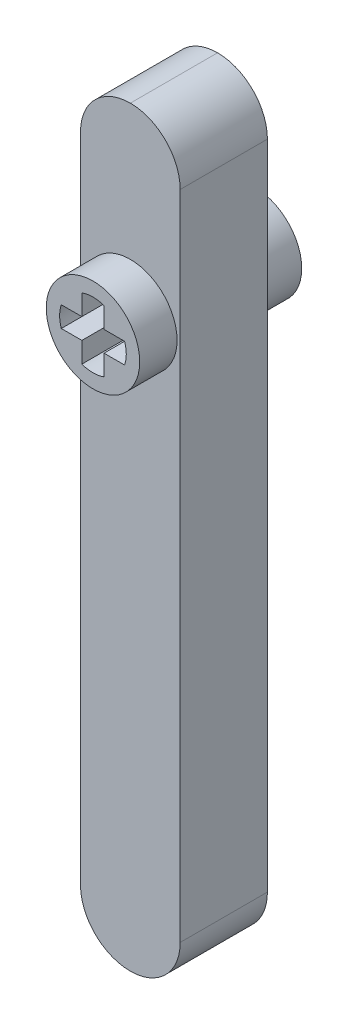
ISO-10303-21;
HEADER;
FILE_DESCRIPTION(('STEP AP214'),'2;1');
FILE_NAME('part.step','',(''),(''),'','','');
FILE_SCHEMA(('AUTOMOTIVE_DESIGN { 1 0 10303 214 1 1 1 1 }'));
ENDSEC;
DATA;
#1=APPLICATION_CONTEXT('core data for automotive mechanical design processes');
#2=APPLICATION_PROTOCOL_DEFINITION('international standard','automotive_design',2000,#1);
#3=PRODUCT_CONTEXT('',#1,'mechanical');
#4=PRODUCT('Part','Part','',(#3));
#5=PRODUCT_RELATED_PRODUCT_CATEGORY('part','',(#4));
#6=PRODUCT_DEFINITION_FORMATION('','',#4);
#7=PRODUCT_DEFINITION_CONTEXT('part definition',#1,'design');
#8=PRODUCT_DEFINITION('design','',#6,#7);
#9=PRODUCT_DEFINITION_SHAPE('','',#8);
#10=(LENGTH_UNIT() NAMED_UNIT(*) SI_UNIT(.MILLI.,.METRE.));
#11=(NAMED_UNIT(*) PLANE_ANGLE_UNIT() SI_UNIT($,.RADIAN.));
#12=(NAMED_UNIT(*) SI_UNIT($,.STERADIAN.) SOLID_ANGLE_UNIT());
#13=UNCERTAINTY_MEASURE_WITH_UNIT(LENGTH_MEASURE(1.E-05),#10,'distance_accuracy_value','');
#14=(GEOMETRIC_REPRESENTATION_CONTEXT(3) GLOBAL_UNCERTAINTY_ASSIGNED_CONTEXT((#13)) GLOBAL_UNIT_ASSIGNED_CONTEXT((#10,
#11,#12)) REPRESENTATION_CONTEXT('',''));
#15=CARTESIAN_POINT('',(0.,0.,0.));
#16=DIRECTION('',(0.,0.,1.));
#17=DIRECTION('',(1.,0.,0.));
#18=AXIS2_PLACEMENT_3D('',#15,#16,#17);
#19=CARTESIAN_POINT('',(0.,20.32,-2.99999997));
#20=DIRECTION('',(0.,0.,1.));
#21=DIRECTION('',(1.,0.,0.));
#22=AXIS2_PLACEMENT_3D('',#19,#20,#21);
#23=PLANE('',#22);
#24=CARTESIAN_POINT('',(0.,20.32,-2.99999997));
#25=DIRECTION('',(0.,0.,1.));
#26=DIRECTION('',(1.,0.,0.));
#27=AXIS2_PLACEMENT_3D('',#24,#25,#26);
#28=CIRCLE('',#27,3.75);
#29=CARTESIAN_POINT('',(3.75,20.32,-2.99999997));
#30=VERTEX_POINT('',#29);
#31=EDGE_CURVE('E263',#30,#30,#28,.T.);
#32=ORIENTED_EDGE('',*,*,#31,.F.);
#33=EDGE_LOOP('',(#32));
#34=FACE_BOUND('',#33,.T.);
#35=CARTESIAN_POINT('',(-0.0745284933708927,20.32,-2.99999997));
#36=DIRECTION('',(0.,0.,-1.));
#37=DIRECTION('',(-1.,0.,0.));
#38=AXIS2_PLACEMENT_3D('',#35,#36,#37);
#39=CIRCLE('',#38,2.6);
#40=CARTESIAN_POINT('',(-2.54,21.1455,-2.99999997));
#41=VERTEX_POINT('',#40);
#42=CARTESIAN_POINT('',(-2.54,19.4945,-2.99999997));
#43=VERTEX_POINT('',#42);
#44=EDGE_CURVE('E54',#41,#43,#39,.F.);
#45=ORIENTED_EDGE('',*,*,#44,.T.);
#46=DIRECTION('',(-1.,0.,0.));
#47=VECTOR('',#46,1.);
#48=CARTESIAN_POINT('',(0.,19.4945,-2.99999997));
#49=LINE('',#48,#47);
#50=CARTESIAN_POINT('',(-0.889,19.4945,-2.99999997));
#51=VERTEX_POINT('',#50);
#52=EDGE_CURVE('E181',#51,#43,#49,.T.);
#53=ORIENTED_EDGE('',*,*,#52,.F.);
#54=DIRECTION('',(0.,1.,0.));
#55=VECTOR('',#54,1.);
#56=CARTESIAN_POINT('',(-0.889000000000005,0.,-2.99999997));
#57=LINE('',#56,#55);
#58=CARTESIAN_POINT('',(-0.889000000000001,17.8435,-2.99999997));
#59=VERTEX_POINT('',#58);
#60=EDGE_CURVE('E184',#59,#51,#57,.T.);
#61=ORIENTED_EDGE('',*,*,#60,.F.);
#62=CARTESIAN_POINT('',(0.,20.286792655414,-2.99999997));
#63=DIRECTION('',(0.,0.,-1.));
#64=DIRECTION('',(-1.,0.,0.));
#65=AXIS2_PLACEMENT_3D('',#62,#63,#64);
#66=CIRCLE('',#65,2.6);
#67=CARTESIAN_POINT('',(0.889000000000001,17.8435,-2.99999997));
#68=VERTEX_POINT('',#67);
#69=EDGE_CURVE('E234',#68,#59,#66,.T.);
#70=ORIENTED_EDGE('',*,*,#69,.F.);
#71=DIRECTION('',(0.,-1.,0.));
#72=VECTOR('',#71,1.);
#73=CARTESIAN_POINT('',(0.889000000000003,0.,-2.99999997));
#74=LINE('',#73,#72);
#75=CARTESIAN_POINT('',(0.889,19.4945,-2.99999997));
#76=VERTEX_POINT('',#75);
#77=EDGE_CURVE('E231',#76,#68,#74,.T.);
#78=ORIENTED_EDGE('',*,*,#77,.F.);
#79=DIRECTION('',(-1.,0.,0.));
#80=VECTOR('',#79,1.);
#81=CARTESIAN_POINT('',(0.,19.4945,-2.99999997));
#82=LINE('',#81,#80);
#83=CARTESIAN_POINT('',(2.54,19.4945,-2.99999997));
#84=VERTEX_POINT('',#83);
#85=EDGE_CURVE('E228',#84,#76,#82,.T.);
#86=ORIENTED_EDGE('',*,*,#85,.F.);
#87=CARTESIAN_POINT('',(0.0745284933708927,20.32,-2.99999997));
#88=DIRECTION('',(0.,0.,-1.));
#89=DIRECTION('',(-1.,0.,0.));
#90=AXIS2_PLACEMENT_3D('',#87,#88,#89);
#91=CIRCLE('',#90,2.6);
#92=CARTESIAN_POINT('',(2.54,21.1455,-2.99999997));
#93=VERTEX_POINT('',#92);
#94=EDGE_CURVE('E225',#93,#84,#91,.T.);
#95=ORIENTED_EDGE('',*,*,#94,.F.);
#96=DIRECTION('',(1.,0.,0.));
#97=VECTOR('',#96,1.);
#98=CARTESIAN_POINT('',(0.,21.1455,-2.99999997));
#99=LINE('',#98,#97);
#100=CARTESIAN_POINT('',(0.889,21.1455,-2.99999997));
#101=VERTEX_POINT('',#100);
#102=EDGE_CURVE('E222',#101,#93,#99,.T.);
#103=ORIENTED_EDGE('',*,*,#102,.F.);
#104=DIRECTION('',(0.,1.,0.));
#105=VECTOR('',#104,1.);
#106=CARTESIAN_POINT('',(0.888999999999995,0.,-2.99999997));
#107=LINE('',#106,#105);
#108=CARTESIAN_POINT('',(0.889000000000001,22.7965,-2.99999997));
#109=VERTEX_POINT('',#108);
#110=EDGE_CURVE('E219',#101,#109,#107,.T.);
#111=ORIENTED_EDGE('',*,*,#110,.T.);
#112=CARTESIAN_POINT('',(0.,20.353207344586,-2.99999997));
#113=DIRECTION('',(0.,0.,-1.));
#114=DIRECTION('',(-1.,0.,0.));
#115=AXIS2_PLACEMENT_3D('',#112,#113,#114);
#116=CIRCLE('',#115,2.6);
#117=CARTESIAN_POINT('',(-0.889000000000001,22.7965,-2.99999997));
#118=VERTEX_POINT('',#117);
#119=EDGE_CURVE('E216',#109,#118,#116,.F.);
#120=ORIENTED_EDGE('',*,*,#119,.T.);
#121=DIRECTION('',(0.,-1.,0.));
#122=VECTOR('',#121,1.);
#123=CARTESIAN_POINT('',(-0.888999999999995,0.,-2.99999997));
#124=LINE('',#123,#122);
#125=CARTESIAN_POINT('',(-0.889,21.1455,-2.99999997));
#126=VERTEX_POINT('',#125);
#127=EDGE_CURVE('E213',#118,#126,#124,.T.);
#128=ORIENTED_EDGE('',*,*,#127,.T.);
#129=DIRECTION('',(-1.,0.,0.));
#130=VECTOR('',#129,1.);
#131=CARTESIAN_POINT('',(0.,21.1455,-2.99999997));
#132=LINE('',#131,#130);
#133=EDGE_CURVE('E211',#126,#41,#132,.T.);
#134=ORIENTED_EDGE('',*,*,#133,.T.);
#135=EDGE_LOOP('',(#45,#53,#61,#70,#78,#86,#95,#103,#111,#120,#128,#134));
#136=FACE_BOUND('',#135,.T.);
#137=ADVANCED_FACE('F37',(#34,#136),#23,.F.);
#138=CARTESIAN_POINT('',(0.,20.32,10.));
#139=DIRECTION('',(0.,0.,1.));
#140=DIRECTION('',(1.,0.,0.));
#141=AXIS2_PLACEMENT_3D('',#138,#139,#140);
#142=PLANE('',#141);
#143=CARTESIAN_POINT('',(0.,20.32,10.));
#144=DIRECTION('',(0.,0.,1.));
#145=DIRECTION('',(1.,0.,0.));
#146=AXIS2_PLACEMENT_3D('',#143,#144,#145);
#147=CIRCLE('',#146,3.75);
#148=CARTESIAN_POINT('',(3.75,20.32,10.));
#149=VERTEX_POINT('',#148);
#150=EDGE_CURVE('E241',#149,#149,#147,.T.);
#151=ORIENTED_EDGE('',*,*,#150,.T.);
#152=EDGE_LOOP('',(#151));
#153=FACE_BOUND('',#152,.T.);
#154=DIRECTION('',(-1.,0.,0.));
#155=VECTOR('',#154,1.);
#156=CARTESIAN_POINT('',(0.,19.4945,10.));
#157=LINE('',#156,#155);
#158=CARTESIAN_POINT('',(-0.889,19.4945,10.));
#159=VERTEX_POINT('',#158);
#160=CARTESIAN_POINT('',(-2.54,19.4945,10.));
#161=VERTEX_POINT('',#160);
#162=EDGE_CURVE('E175',#159,#161,#157,.T.);
#163=ORIENTED_EDGE('',*,*,#162,.T.);
#164=CARTESIAN_POINT('',(-0.0745284933708927,20.32,10.));
#165=DIRECTION('',(0.,0.,-1.));
#166=DIRECTION('',(-1.,0.,0.));
#167=AXIS2_PLACEMENT_3D('',#164,#165,#166);
#168=CIRCLE('',#167,2.6);
#169=CARTESIAN_POINT('',(-2.54,21.1455,10.));
#170=VERTEX_POINT('',#169);
#171=EDGE_CURVE('E171',#170,#161,#168,.F.);
#172=ORIENTED_EDGE('',*,*,#171,.F.);
#173=DIRECTION('',(-1.,0.,0.));
#174=VECTOR('',#173,1.);
#175=CARTESIAN_POINT('',(0.,21.1455,10.));
#176=LINE('',#175,#174);
#177=CARTESIAN_POINT('',(-0.889,21.1455,10.));
#178=VERTEX_POINT('',#177);
#179=EDGE_CURVE('E163',#178,#170,#176,.T.);
#180=ORIENTED_EDGE('',*,*,#179,.F.);
#181=DIRECTION('',(0.,-1.,0.));
#182=VECTOR('',#181,1.);
#183=CARTESIAN_POINT('',(-0.888999999999995,0.,10.));
#184=LINE('',#183,#182);
#185=CARTESIAN_POINT('',(-0.889000000000001,22.7965,10.));
#186=VERTEX_POINT('',#185);
#187=EDGE_CURVE('E170',#186,#178,#184,.T.);
#188=ORIENTED_EDGE('',*,*,#187,.F.);
#189=CARTESIAN_POINT('',(0.,20.353207344586,10.));
#190=DIRECTION('',(0.,0.,-1.));
#191=DIRECTION('',(-1.,0.,0.));
#192=AXIS2_PLACEMENT_3D('',#189,#190,#191);
#193=CIRCLE('',#192,2.6);
#194=CARTESIAN_POINT('',(0.889000000000001,22.7965,10.));
#195=VERTEX_POINT('',#194);
#196=EDGE_CURVE('E188',#195,#186,#193,.F.);
#197=ORIENTED_EDGE('',*,*,#196,.F.);
#198=DIRECTION('',(0.,1.,0.));
#199=VECTOR('',#198,1.);
#200=CARTESIAN_POINT('',(0.888999999999995,0.,10.));
#201=LINE('',#200,#199);
#202=CARTESIAN_POINT('',(0.889,21.1455,10.));
#203=VERTEX_POINT('',#202);
#204=EDGE_CURVE('E190',#203,#195,#201,.T.);
#205=ORIENTED_EDGE('',*,*,#204,.F.);
#206=DIRECTION('',(1.,0.,0.));
#207=VECTOR('',#206,1.);
#208=CARTESIAN_POINT('',(0.,21.1455,10.));
#209=LINE('',#208,#207);
#210=CARTESIAN_POINT('',(2.54,21.1455,10.));
#211=VERTEX_POINT('',#210);
#212=EDGE_CURVE('E192',#203,#211,#209,.T.);
#213=ORIENTED_EDGE('',*,*,#212,.T.);
#214=CARTESIAN_POINT('',(0.0745284933708927,20.32,10.));
#215=DIRECTION('',(0.,0.,-1.));
#216=DIRECTION('',(-1.,0.,0.));
#217=AXIS2_PLACEMENT_3D('',#214,#215,#216);
#218=CIRCLE('',#217,2.6);
#219=CARTESIAN_POINT('',(2.54,19.4945,10.));
#220=VERTEX_POINT('',#219);
#221=EDGE_CURVE('E195',#211,#220,#218,.T.);
#222=ORIENTED_EDGE('',*,*,#221,.T.);
#223=DIRECTION('',(-1.,0.,0.));
#224=VECTOR('',#223,1.);
#225=CARTESIAN_POINT('',(0.,19.4945,10.));
#226=LINE('',#225,#224);
#227=CARTESIAN_POINT('',(0.889,19.4945,10.));
#228=VERTEX_POINT('',#227);
#229=EDGE_CURVE('E198',#220,#228,#226,.T.);
#230=ORIENTED_EDGE('',*,*,#229,.T.);
#231=DIRECTION('',(0.,-1.,0.));
#232=VECTOR('',#231,1.);
#233=CARTESIAN_POINT('',(0.889000000000003,0.,10.));
#234=LINE('',#233,#232);
#235=CARTESIAN_POINT('',(0.889000000000001,17.8435,10.));
#236=VERTEX_POINT('',#235);
#237=EDGE_CURVE('E201',#228,#236,#234,.T.);
#238=ORIENTED_EDGE('',*,*,#237,.T.);
#239=CARTESIAN_POINT('',(0.,20.286792655414,10.));
#240=DIRECTION('',(0.,0.,-1.));
#241=DIRECTION('',(-1.,0.,0.));
#242=AXIS2_PLACEMENT_3D('',#239,#240,#241);
#243=CIRCLE('',#242,2.6);
#244=CARTESIAN_POINT('',(-0.889000000000001,17.8435,10.));
#245=VERTEX_POINT('',#244);
#246=EDGE_CURVE('E204',#236,#245,#243,.T.);
#247=ORIENTED_EDGE('',*,*,#246,.T.);
#248=DIRECTION('',(0.,1.,0.));
#249=VECTOR('',#248,1.);
#250=CARTESIAN_POINT('',(-0.889000000000005,0.,10.));
#251=LINE('',#250,#249);
#252=EDGE_CURVE('E207',#245,#159,#251,.T.);
#253=ORIENTED_EDGE('',*,*,#252,.T.);
#254=EDGE_LOOP('',(#163,#172,#180,#188,#197,#205,#213,#222,#230,#238,#247,#253));
#255=FACE_BOUND('',#254,.T.);
#256=ADVANCED_FACE('F178',(#153,#255),#142,.T.);
#257=CARTESIAN_POINT('',(3.99999999999999,25.4,7.));
#258=DIRECTION('',(-1.,0.,0.));
#259=DIRECTION('',(0.,-1.,0.));
#260=AXIS2_PLACEMENT_3D('',#257,#258,#259);
#261=PLANE('',#260);
#262=DIRECTION('',(0.,1.,0.));
#263=VECTOR('',#262,1.);
#264=CARTESIAN_POINT('',(3.99999999999999,25.4,0.));
#265=LINE('',#264,#263);
#266=CARTESIAN_POINT('',(3.99999999999999,-21.4,0.));
#267=VERTEX_POINT('',#266);
#268=CARTESIAN_POINT('',(4.,30.925,0.));
#269=VERTEX_POINT('',#268);
#270=EDGE_CURVE('E274',#267,#269,#265,.T.);
#271=ORIENTED_EDGE('',*,*,#270,.T.);
#272=DIRECTION('',(0.,0.,-1.));
#273=VECTOR('',#272,1.);
#274=CARTESIAN_POINT('',(4.,30.925,7.));
#275=LINE('',#274,#273);
#276=CARTESIAN_POINT('',(3.99999999999999,30.925,7.));
#277=VERTEX_POINT('',#276);
#278=EDGE_CURVE('E289',#269,#277,#275,.F.);
#279=ORIENTED_EDGE('',*,*,#278,.T.);
#280=DIRECTION('',(0.,1.,0.));
#281=VECTOR('',#280,1.);
#282=CARTESIAN_POINT('',(3.99999999999999,25.4,7.));
#283=LINE('',#282,#281);
#284=CARTESIAN_POINT('',(4.,-21.4,7.));
#285=VERTEX_POINT('',#284);
#286=EDGE_CURVE('E266',#285,#277,#283,.T.);
#287=ORIENTED_EDGE('',*,*,#286,.F.);
#288=DIRECTION('',(0.,0.,-1.));
#289=VECTOR('',#288,1.);
#290=CARTESIAN_POINT('',(3.99999999999999,-21.4,7.));
#291=LINE('',#290,#289);
#292=EDGE_CURVE('E287',#285,#267,#291,.T.);
#293=ORIENTED_EDGE('',*,*,#292,.T.);
#294=EDGE_LOOP('',(#271,#279,#287,#293));
#295=FACE_BOUND('',#294,.T.);
#296=ADVANCED_FACE('F334',(#295),#261,.F.);
#297=CARTESIAN_POINT('',(-4.00000000000001,25.4,7.));
#298=DIRECTION('',(1.,0.,0.));
#299=DIRECTION('',(0.,1.,0.));
#300=AXIS2_PLACEMENT_3D('',#297,#298,#299);
#301=PLANE('',#300);
#302=DIRECTION('',(0.,-1.,0.));
#303=VECTOR('',#302,1.);
#304=CARTESIAN_POINT('',(-4.,34.925,7.));
#305=LINE('',#304,#303);
#306=CARTESIAN_POINT('',(-4.,30.925,7.));
#307=VERTEX_POINT('',#306);
#308=CARTESIAN_POINT('',(-4.00000000000001,-21.4,7.));
#309=VERTEX_POINT('',#308);
#310=EDGE_CURVE('E269',#307,#309,#305,.T.);
#311=ORIENTED_EDGE('',*,*,#310,.F.);
#312=DIRECTION('',(0.,0.,-1.));
#313=VECTOR('',#312,1.);
#314=CARTESIAN_POINT('',(-4.00000000000001,30.925,7.));
#315=LINE('',#314,#313);
#316=CARTESIAN_POINT('',(-4.00000000000001,30.925,0.));
#317=VERTEX_POINT('',#316);
#318=EDGE_CURVE('E46',#307,#317,#315,.T.);
#319=ORIENTED_EDGE('',*,*,#318,.T.);
#320=DIRECTION('',(0.,-1.,0.));
#321=VECTOR('',#320,1.);
#322=CARTESIAN_POINT('',(-4.00000000000001,25.4,0.));
#323=LINE('',#322,#321);
#324=CARTESIAN_POINT('',(-4.,-21.4,0.));
#325=VERTEX_POINT('',#324);
#326=EDGE_CURVE('E270',#317,#325,#323,.T.);
#327=ORIENTED_EDGE('',*,*,#326,.T.);
#328=DIRECTION('',(0.,0.,-1.));
#329=VECTOR('',#328,1.);
#330=CARTESIAN_POINT('',(-4.,-21.4,7.));
#331=LINE('',#330,#329);
#332=EDGE_CURVE('E300',#325,#309,#331,.F.);
#333=ORIENTED_EDGE('',*,*,#332,.T.);
#334=EDGE_LOOP('',(#311,#319,#327,#333));
#335=FACE_BOUND('',#334,.T.);
#336=ADVANCED_FACE('F582',(#335),#301,.F.);
#337=CARTESIAN_POINT('',(0.,0.,7.));
#338=DIRECTION('',(0.,0.,1.));
#339=DIRECTION('',(1.,0.,0.));
#340=AXIS2_PLACEMENT_3D('',#337,#338,#339);
#341=PLANE('',#340);
#342=CARTESIAN_POINT('',(0.,20.32,7.));
#343=DIRECTION('',(0.,0.,1.));
#344=DIRECTION('',(1.,0.,0.));
#345=AXIS2_PLACEMENT_3D('',#342,#343,#344);
#346=CIRCLE('',#345,3.75);
#347=CARTESIAN_POINT('',(3.75,20.32,7.));
#348=VERTEX_POINT('',#347);
#349=EDGE_CURVE('E11',#348,#348,#346,.T.);
#350=ORIENTED_EDGE('',*,*,#349,.F.);
#351=EDGE_LOOP('',(#350));
#352=FACE_BOUND('',#351,.T.);
#353=ORIENTED_EDGE('',*,*,#286,.T.);
#354=CARTESIAN_POINT('',(0.,30.925,7.));
#355=DIRECTION('',(0.,0.,1.));
#356=DIRECTION('',(1.,0.,0.));
#357=AXIS2_PLACEMENT_3D('',#354,#355,#356);
#358=CIRCLE('',#357,4.);
#359=CARTESIAN_POINT('',(0.,34.925,7.));
#360=VERTEX_POINT('',#359);
#361=EDGE_CURVE('E298',#277,#360,#358,.T.);
#362=ORIENTED_EDGE('',*,*,#361,.T.);
#363=CARTESIAN_POINT('',(0.,30.925,7.));
#364=DIRECTION('',(0.,0.,1.));
#365=DIRECTION('',(1.,0.,0.));
#366=AXIS2_PLACEMENT_3D('',#363,#364,#365);
#367=CIRCLE('',#366,4.);
#368=EDGE_CURVE('E296',#360,#307,#367,.T.);
#369=ORIENTED_EDGE('',*,*,#368,.T.);
#370=ORIENTED_EDGE('',*,*,#310,.T.);
#371=CARTESIAN_POINT('',(0.,-21.4,7.));
#372=DIRECTION('',(0.,0.,1.));
#373=DIRECTION('',(1.,0.,0.));
#374=AXIS2_PLACEMENT_3D('',#371,#372,#373);
#375=CIRCLE('',#374,4.);
#376=CARTESIAN_POINT('',(0.,-25.4,7.));
#377=VERTEX_POINT('',#376);
#378=EDGE_CURVE('E294',#309,#377,#375,.T.);
#379=ORIENTED_EDGE('',*,*,#378,.T.);
#380=CARTESIAN_POINT('',(0.,-21.4,7.));
#381=DIRECTION('',(0.,0.,1.));
#382=DIRECTION('',(1.,0.,0.));
#383=AXIS2_PLACEMENT_3D('',#380,#381,#382);
#384=CIRCLE('',#383,4.);
#385=EDGE_CURVE('E292',#377,#285,#384,.T.);
#386=ORIENTED_EDGE('',*,*,#385,.T.);
#387=EDGE_LOOP('',(#353,#362,#369,#370,#379,#386));
#388=FACE_BOUND('',#387,.T.);
#389=ADVANCED_FACE('F573',(#352,#388),#341,.T.);
#390=CARTESIAN_POINT('',(0.,0.,0.));
#391=DIRECTION('',(0.,0.,1.));
#392=DIRECTION('',(1.,0.,0.));
#393=AXIS2_PLACEMENT_3D('',#390,#391,#392);
#394=PLANE('',#393);
#395=CARTESIAN_POINT('',(0.,20.32,0.));
#396=DIRECTION('',(0.,0.,1.));
#397=DIRECTION('',(1.,0.,0.));
#398=AXIS2_PLACEMENT_3D('',#395,#396,#397);
#399=CIRCLE('',#398,3.75);
#400=CARTESIAN_POINT('',(3.75,20.32,0.));
#401=VERTEX_POINT('',#400);
#402=EDGE_CURVE('E41',#401,#401,#399,.T.);
#403=ORIENTED_EDGE('',*,*,#402,.T.);
#404=EDGE_LOOP('',(#403));
#405=FACE_BOUND('',#404,.T.);
#406=CARTESIAN_POINT('',(0.,30.925,0.));
#407=DIRECTION('',(0.,0.,1.));
#408=DIRECTION('',(1.,0.,0.));
#409=AXIS2_PLACEMENT_3D('',#406,#407,#408);
#410=CIRCLE('',#409,4.);
#411=CARTESIAN_POINT('',(0.,34.925,0.));
#412=VERTEX_POINT('',#411);
#413=EDGE_CURVE('E283',#317,#412,#410,.F.);
#414=ORIENTED_EDGE('',*,*,#413,.T.);
#415=CARTESIAN_POINT('',(0.,30.925,0.));
#416=DIRECTION('',(0.,0.,1.));
#417=DIRECTION('',(1.,0.,0.));
#418=AXIS2_PLACEMENT_3D('',#415,#416,#417);
#419=CIRCLE('',#418,4.);
#420=EDGE_CURVE('E285',#412,#269,#419,.F.);
#421=ORIENTED_EDGE('',*,*,#420,.T.);
#422=ORIENTED_EDGE('',*,*,#270,.F.);
#423=CARTESIAN_POINT('',(0.,-21.4,0.));
#424=DIRECTION('',(0.,0.,1.));
#425=DIRECTION('',(1.,0.,0.));
#426=AXIS2_PLACEMENT_3D('',#423,#424,#425);
#427=CIRCLE('',#426,4.);
#428=CARTESIAN_POINT('',(0.,-25.4,0.));
#429=VERTEX_POINT('',#428);
#430=EDGE_CURVE('E273',#267,#429,#427,.F.);
#431=ORIENTED_EDGE('',*,*,#430,.T.);
#432=CARTESIAN_POINT('',(0.,-21.4,0.));
#433=DIRECTION('',(0.,0.,1.));
#434=DIRECTION('',(1.,0.,0.));
#435=AXIS2_PLACEMENT_3D('',#432,#433,#434);
#436=CIRCLE('',#435,4.);
#437=EDGE_CURVE('E281',#429,#325,#436,.F.);
#438=ORIENTED_EDGE('',*,*,#437,.T.);
#439=ORIENTED_EDGE('',*,*,#326,.F.);
#440=EDGE_LOOP('',(#414,#421,#422,#431,#438,#439));
#441=FACE_BOUND('',#440,.T.);
#442=ADVANCED_FACE('F313',(#405,#441),#394,.F.);
#443=CARTESIAN_POINT('',(0.,30.925,7.));
#444=DIRECTION('',(0.,0.,-1.));
#445=DIRECTION('',(-1.,0.,0.));
#446=AXIS2_PLACEMENT_3D('',#443,#444,#445);
#447=CYLINDRICAL_SURFACE('',#446,4.);
#448=ORIENTED_EDGE('',*,*,#318,.F.);
#449=ORIENTED_EDGE('',*,*,#368,.F.);
#450=DIRECTION('',(0.,0.,-1.));
#451=VECTOR('',#450,1.);
#452=CARTESIAN_POINT('',(0.,34.925,7.));
#453=LINE('',#452,#451);
#454=EDGE_CURVE('E277',#412,#360,#453,.F.);
#455=ORIENTED_EDGE('',*,*,#454,.F.);
#456=ORIENTED_EDGE('',*,*,#413,.F.);
#457=EDGE_LOOP('',(#448,#449,#455,#456));
#458=FACE_BOUND('',#457,.T.);
#459=ADVANCED_FACE('F552',(#458),#447,.T.);
#460=CARTESIAN_POINT('',(0.,30.925,7.));
#461=DIRECTION('',(0.,0.,-1.));
#462=DIRECTION('',(-1.,0.,0.));
#463=AXIS2_PLACEMENT_3D('',#460,#461,#462);
#464=CYLINDRICAL_SURFACE('',#463,4.);
#465=ORIENTED_EDGE('',*,*,#361,.F.);
#466=ORIENTED_EDGE('',*,*,#278,.F.);
#467=ORIENTED_EDGE('',*,*,#420,.F.);
#468=ORIENTED_EDGE('',*,*,#454,.T.);
#469=EDGE_LOOP('',(#465,#466,#467,#468));
#470=FACE_BOUND('',#469,.T.);
#471=ADVANCED_FACE('F542',(#470),#464,.T.);
#472=CARTESIAN_POINT('',(0.,-21.4,7.));
#473=DIRECTION('',(0.,0.,-1.));
#474=DIRECTION('',(-1.,0.,0.));
#475=AXIS2_PLACEMENT_3D('',#472,#473,#474);
#476=CYLINDRICAL_SURFACE('',#475,4.);
#477=ORIENTED_EDGE('',*,*,#292,.F.);
#478=ORIENTED_EDGE('',*,*,#385,.F.);
#479=DIRECTION('',(0.,0.,-1.));
#480=VECTOR('',#479,1.);
#481=CARTESIAN_POINT('',(0.,-25.4,7.));
#482=LINE('',#481,#480);
#483=EDGE_CURVE('E305',#429,#377,#482,.F.);
#484=ORIENTED_EDGE('',*,*,#483,.F.);
#485=ORIENTED_EDGE('',*,*,#430,.F.);
#486=EDGE_LOOP('',(#477,#478,#484,#485));
#487=FACE_BOUND('',#486,.T.);
#488=ADVANCED_FACE('F39',(#487),#476,.T.);
#489=CARTESIAN_POINT('',(0.,-21.4,7.));
#490=DIRECTION('',(0.,0.,-1.));
#491=DIRECTION('',(-1.,0.,0.));
#492=AXIS2_PLACEMENT_3D('',#489,#490,#491);
#493=CYLINDRICAL_SURFACE('',#492,4.);
#494=ORIENTED_EDGE('',*,*,#378,.F.);
#495=ORIENTED_EDGE('',*,*,#332,.F.);
#496=ORIENTED_EDGE('',*,*,#437,.F.);
#497=ORIENTED_EDGE('',*,*,#483,.T.);
#498=EDGE_LOOP('',(#494,#495,#496,#497));
#499=FACE_BOUND('',#498,.T.);
#500=ADVANCED_FACE('F319',(#499),#493,.T.);
#501=CARTESIAN_POINT('',(0.,20.32,-2.99999997));
#502=DIRECTION('',(0.,0.,1.));
#503=DIRECTION('',(1.,0.,0.));
#504=AXIS2_PLACEMENT_3D('',#501,#502,#503);
#505=CYLINDRICAL_SURFACE('',#504,3.75);
#506=ORIENTED_EDGE('',*,*,#31,.T.);
#507=EDGE_LOOP('',(#506));
#508=FACE_BOUND('',#507,.T.);
#509=ORIENTED_EDGE('',*,*,#402,.F.);
#510=EDGE_LOOP('',(#509));
#511=FACE_BOUND('',#510,.T.);
#512=ADVANCED_FACE('F316',(#508,#511),#505,.T.);
#513=ORIENTED_EDGE('',*,*,#349,.T.);
#514=EDGE_LOOP('',(#513));
#515=FACE_BOUND('',#514,.T.);
#516=ORIENTED_EDGE('',*,*,#150,.F.);
#517=EDGE_LOOP('',(#516));
#518=FACE_BOUND('',#517,.T.);
#519=ADVANCED_FACE('F318',(#515,#518),#505,.T.);
#520=CARTESIAN_POINT('',(-0.0745284933708927,20.32,10.));
#521=DIRECTION('',(0.,0.,-1.));
#522=DIRECTION('',(-1.,0.,0.));
#523=AXIS2_PLACEMENT_3D('',#520,#521,#522);
#524=CYLINDRICAL_SURFACE('',#523,2.6);
#525=ORIENTED_EDGE('',*,*,#44,.F.);
#526=DIRECTION('',(0.,0.,-1.));
#527=VECTOR('',#526,1.);
#528=CARTESIAN_POINT('',(-2.54,21.1455,10.));
#529=LINE('',#528,#527);
#530=EDGE_CURVE('E165',#170,#41,#529,.T.);
#531=ORIENTED_EDGE('',*,*,#530,.F.);
#532=ORIENTED_EDGE('',*,*,#171,.T.);
#533=DIRECTION('',(0.,0.,-1.));
#534=VECTOR('',#533,1.);
#535=CARTESIAN_POINT('',(-2.54,19.4945,10.));
#536=LINE('',#535,#534);
#537=EDGE_CURVE('E239',#161,#43,#536,.T.);
#538=ORIENTED_EDGE('',*,*,#537,.T.);
#539=EDGE_LOOP('',(#525,#531,#532,#538));
#540=FACE_BOUND('',#539,.T.);
#541=ADVANCED_FACE('F173',(#540),#524,.F.);
#542=CARTESIAN_POINT('',(0.,19.4945,10.));
#543=DIRECTION('',(0.,-1.,0.));
#544=DIRECTION('',(0.,0.,-1.));
#545=AXIS2_PLACEMENT_3D('',#542,#543,#544);
#546=PLANE('',#545);
#547=ORIENTED_EDGE('',*,*,#52,.T.);
#548=ORIENTED_EDGE('',*,*,#537,.F.);
#549=ORIENTED_EDGE('',*,*,#162,.F.);
#550=DIRECTION('',(0.,0.,-1.));
#551=VECTOR('',#550,1.);
#552=CARTESIAN_POINT('',(-0.889,19.4945,10.));
#553=LINE('',#552,#551);
#554=EDGE_CURVE('E242',#159,#51,#553,.T.);
#555=ORIENTED_EDGE('',*,*,#554,.T.);
#556=EDGE_LOOP('',(#547,#548,#549,#555));
#557=FACE_BOUND('',#556,.T.);
#558=ADVANCED_FACE('F342',(#557),#546,.F.);
#559=CARTESIAN_POINT('',(-0.889000000000005,0.,10.));
#560=DIRECTION('',(-1.,0.,0.));
#561=DIRECTION('',(0.,-1.,0.));
#562=AXIS2_PLACEMENT_3D('',#559,#560,#561);
#563=PLANE('',#562);
#564=ORIENTED_EDGE('',*,*,#60,.T.);
#565=ORIENTED_EDGE('',*,*,#554,.F.);
#566=ORIENTED_EDGE('',*,*,#252,.F.);
#567=DIRECTION('',(0.,0.,-1.));
#568=VECTOR('',#567,1.);
#569=CARTESIAN_POINT('',(-0.889000000000001,17.8435,10.));
#570=LINE('',#569,#568);
#571=EDGE_CURVE('E244',#245,#59,#570,.T.);
#572=ORIENTED_EDGE('',*,*,#571,.T.);
#573=EDGE_LOOP('',(#564,#565,#566,#572));
#574=FACE_BOUND('',#573,.T.);
#575=ADVANCED_FACE('F376',(#574),#563,.F.);
#576=CARTESIAN_POINT('',(0.,20.286792655414,10.));
#577=DIRECTION('',(0.,0.,-1.));
#578=DIRECTION('',(-1.,0.,0.));
#579=AXIS2_PLACEMENT_3D('',#576,#577,#578);
#580=CYLINDRICAL_SURFACE('',#579,2.6);
#581=ORIENTED_EDGE('',*,*,#69,.T.);
#582=ORIENTED_EDGE('',*,*,#571,.F.);
#583=ORIENTED_EDGE('',*,*,#246,.F.);
#584=DIRECTION('',(0.,0.,-1.));
#585=VECTOR('',#584,1.);
#586=CARTESIAN_POINT('',(0.889000000000001,17.8435,10.));
#587=LINE('',#586,#585);
#588=EDGE_CURVE('E246',#236,#68,#587,.T.);
#589=ORIENTED_EDGE('',*,*,#588,.T.);
#590=EDGE_LOOP('',(#581,#582,#583,#589));
#591=FACE_BOUND('',#590,.T.);
#592=ADVANCED_FACE('F372',(#591),#580,.F.);
#593=CARTESIAN_POINT('',(0.889000000000003,0.,10.));
#594=DIRECTION('',(1.,0.,0.));
#595=DIRECTION('',(0.,1.,0.));
#596=AXIS2_PLACEMENT_3D('',#593,#594,#595);
#597=PLANE('',#596);
#598=ORIENTED_EDGE('',*,*,#77,.T.);
#599=ORIENTED_EDGE('',*,*,#588,.F.);
#600=ORIENTED_EDGE('',*,*,#237,.F.);
#601=DIRECTION('',(0.,0.,-1.));
#602=VECTOR('',#601,1.);
#603=CARTESIAN_POINT('',(0.889,19.4945,10.));
#604=LINE('',#603,#602);
#605=EDGE_CURVE('E248',#228,#76,#604,.T.);
#606=ORIENTED_EDGE('',*,*,#605,.T.);
#607=EDGE_LOOP('',(#598,#599,#600,#606));
#608=FACE_BOUND('',#607,.T.);
#609=ADVANCED_FACE('F368',(#608),#597,.F.);
#610=CARTESIAN_POINT('',(0.,19.4945,10.));
#611=DIRECTION('',(0.,-1.,0.));
#612=DIRECTION('',(0.,0.,-1.));
#613=AXIS2_PLACEMENT_3D('',#610,#611,#612);
#614=PLANE('',#613);
#615=ORIENTED_EDGE('',*,*,#85,.T.);
#616=ORIENTED_EDGE('',*,*,#605,.F.);
#617=ORIENTED_EDGE('',*,*,#229,.F.);
#618=DIRECTION('',(0.,0.,-1.));
#619=VECTOR('',#618,1.);
#620=CARTESIAN_POINT('',(2.54,19.4945,10.));
#621=LINE('',#620,#619);
#622=EDGE_CURVE('E250',#220,#84,#621,.T.);
#623=ORIENTED_EDGE('',*,*,#622,.T.);
#624=EDGE_LOOP('',(#615,#616,#617,#623));
#625=FACE_BOUND('',#624,.T.);
#626=ADVANCED_FACE('F364',(#625),#614,.F.);
#627=CARTESIAN_POINT('',(0.0745284933708927,20.32,10.));
#628=DIRECTION('',(0.,0.,-1.));
#629=DIRECTION('',(-1.,0.,0.));
#630=AXIS2_PLACEMENT_3D('',#627,#628,#629);
#631=CYLINDRICAL_SURFACE('',#630,2.6);
#632=ORIENTED_EDGE('',*,*,#94,.T.);
#633=ORIENTED_EDGE('',*,*,#622,.F.);
#634=ORIENTED_EDGE('',*,*,#221,.F.);
#635=DIRECTION('',(0.,0.,-1.));
#636=VECTOR('',#635,1.);
#637=CARTESIAN_POINT('',(2.54,21.1455,10.));
#638=LINE('',#637,#636);
#639=EDGE_CURVE('E252',#211,#93,#638,.T.);
#640=ORIENTED_EDGE('',*,*,#639,.T.);
#641=EDGE_LOOP('',(#632,#633,#634,#640));
#642=FACE_BOUND('',#641,.T.);
#643=ADVANCED_FACE('F360',(#642),#631,.F.);
#644=CARTESIAN_POINT('',(0.,21.1455,10.));
#645=DIRECTION('',(0.,1.,0.));
#646=DIRECTION('',(0.,0.,1.));
#647=AXIS2_PLACEMENT_3D('',#644,#645,#646);
#648=PLANE('',#647);
#649=ORIENTED_EDGE('',*,*,#102,.T.);
#650=ORIENTED_EDGE('',*,*,#639,.F.);
#651=ORIENTED_EDGE('',*,*,#212,.F.);
#652=DIRECTION('',(0.,0.,-1.));
#653=VECTOR('',#652,1.);
#654=CARTESIAN_POINT('',(0.889,21.1455,10.));
#655=LINE('',#654,#653);
#656=EDGE_CURVE('E254',#203,#101,#655,.T.);
#657=ORIENTED_EDGE('',*,*,#656,.T.);
#658=EDGE_LOOP('',(#649,#650,#651,#657));
#659=FACE_BOUND('',#658,.T.);
#660=ADVANCED_FACE('F356',(#659),#648,.F.);
#661=CARTESIAN_POINT('',(0.888999999999995,0.,10.));
#662=DIRECTION('',(-1.,0.,0.));
#663=DIRECTION('',(0.,-1.,0.));
#664=AXIS2_PLACEMENT_3D('',#661,#662,#663);
#665=PLANE('',#664);
#666=ORIENTED_EDGE('',*,*,#110,.F.);
#667=ORIENTED_EDGE('',*,*,#656,.F.);
#668=ORIENTED_EDGE('',*,*,#204,.T.);
#669=DIRECTION('',(0.,0.,-1.));
#670=VECTOR('',#669,1.);
#671=CARTESIAN_POINT('',(0.889000000000001,22.7965,10.));
#672=LINE('',#671,#670);
#673=EDGE_CURVE('E256',#195,#109,#672,.T.);
#674=ORIENTED_EDGE('',*,*,#673,.T.);
#675=EDGE_LOOP('',(#666,#667,#668,#674));
#676=FACE_BOUND('',#675,.T.);
#677=ADVANCED_FACE('F352',(#676),#665,.T.);
#678=CARTESIAN_POINT('',(0.,20.353207344586,10.));
#679=DIRECTION('',(0.,0.,-1.));
#680=DIRECTION('',(-1.,0.,0.));
#681=AXIS2_PLACEMENT_3D('',#678,#679,#680);
#682=CYLINDRICAL_SURFACE('',#681,2.6);
#683=ORIENTED_EDGE('',*,*,#119,.F.);
#684=ORIENTED_EDGE('',*,*,#673,.F.);
#685=ORIENTED_EDGE('',*,*,#196,.T.);
#686=DIRECTION('',(0.,0.,-1.));
#687=VECTOR('',#686,1.);
#688=CARTESIAN_POINT('',(-0.889000000000001,22.7965,10.));
#689=LINE('',#688,#687);
#690=EDGE_CURVE('E258',#186,#118,#689,.T.);
#691=ORIENTED_EDGE('',*,*,#690,.T.);
#692=EDGE_LOOP('',(#683,#684,#685,#691));
#693=FACE_BOUND('',#692,.T.);
#694=ADVANCED_FACE('F348',(#693),#682,.F.);
#695=CARTESIAN_POINT('',(-0.888999999999995,0.,10.));
#696=DIRECTION('',(1.,0.,0.));
#697=DIRECTION('',(0.,1.,0.));
#698=AXIS2_PLACEMENT_3D('',#695,#696,#697);
#699=PLANE('',#698);
#700=ORIENTED_EDGE('',*,*,#127,.F.);
#701=ORIENTED_EDGE('',*,*,#690,.F.);
#702=ORIENTED_EDGE('',*,*,#187,.T.);
#703=DIRECTION('',(0.,0.,-1.));
#704=VECTOR('',#703,1.);
#705=CARTESIAN_POINT('',(-0.889,21.1455,10.));
#706=LINE('',#705,#704);
#707=EDGE_CURVE('E62',#178,#126,#706,.T.);
#708=ORIENTED_EDGE('',*,*,#707,.T.);
#709=EDGE_LOOP('',(#700,#701,#702,#708));
#710=FACE_BOUND('',#709,.T.);
#711=ADVANCED_FACE('F345',(#710),#699,.T.);
#712=CARTESIAN_POINT('',(0.,21.1455,10.));
#713=DIRECTION('',(0.,-1.,0.));
#714=DIRECTION('',(0.,0.,-1.));
#715=AXIS2_PLACEMENT_3D('',#712,#713,#714);
#716=PLANE('',#715);
#717=ORIENTED_EDGE('',*,*,#133,.F.);
#718=ORIENTED_EDGE('',*,*,#707,.F.);
#719=ORIENTED_EDGE('',*,*,#179,.T.);
#720=ORIENTED_EDGE('',*,*,#530,.T.);
#721=EDGE_LOOP('',(#717,#718,#719,#720));
#722=FACE_BOUND('',#721,.T.);
#723=ADVANCED_FACE('F164',(#722),#716,.T.);
#724=CLOSED_SHELL('',(#137,#256,#296,#336,#389,#442,#459,#471,#488,#500,#512,#519,#541,#558,
#575,#592,#609,#626,#643,#660,#677,#694,#711,#723));
#725=MANIFOLD_SOLID_BREP('B2',#724);
#726=ADVANCED_BREP_SHAPE_REPRESENTATION('',(#18,#725),#14);
#727=SHAPE_DEFINITION_REPRESENTATION(#9,#726);
ENDSEC;
END-ISO-10303-21;
